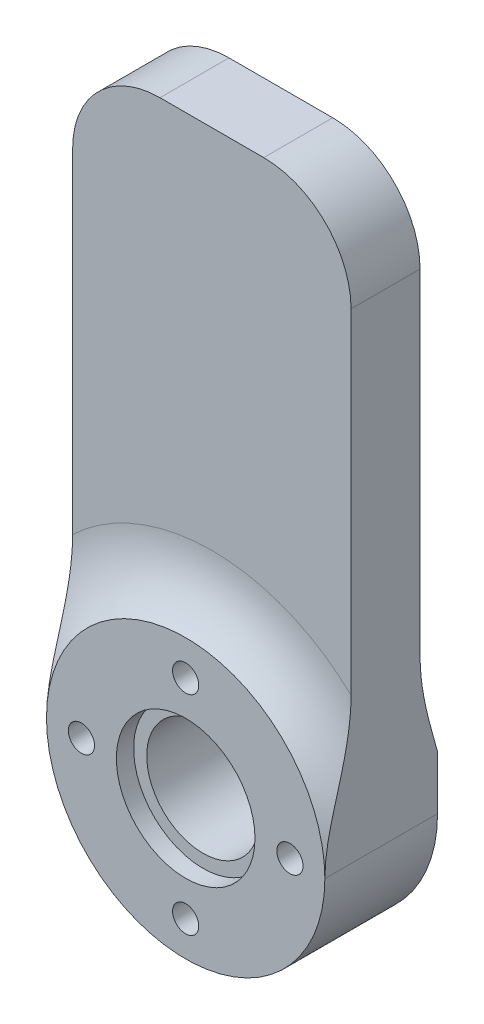
ISO-10303-21;
HEADER;
FILE_DESCRIPTION(('STEP AP214'),'2;1');
FILE_NAME('part.step','',(''),(''),'','','');
FILE_SCHEMA(('AUTOMOTIVE_DESIGN { 1 0 10303 214 1 1 1 1 }'));
ENDSEC;
DATA;
#1=APPLICATION_CONTEXT('core data for automotive mechanical design processes');
#2=APPLICATION_PROTOCOL_DEFINITION('international standard','automotive_design',2000,#1);
#3=PRODUCT_CONTEXT('',#1,'mechanical');
#4=PRODUCT('Part','Part','',(#3));
#5=PRODUCT_RELATED_PRODUCT_CATEGORY('part','',(#4));
#6=PRODUCT_DEFINITION_FORMATION('','',#4);
#7=PRODUCT_DEFINITION_CONTEXT('part definition',#1,'design');
#8=PRODUCT_DEFINITION('design','',#6,#7);
#9=PRODUCT_DEFINITION_SHAPE('','',#8);
#10=(LENGTH_UNIT() NAMED_UNIT(*) SI_UNIT(.MILLI.,.METRE.));
#11=(NAMED_UNIT(*) PLANE_ANGLE_UNIT() SI_UNIT($,.RADIAN.));
#12=(NAMED_UNIT(*) SI_UNIT($,.STERADIAN.) SOLID_ANGLE_UNIT());
#13=UNCERTAINTY_MEASURE_WITH_UNIT(LENGTH_MEASURE(1.E-05),#10,'distance_accuracy_value','');
#14=(GEOMETRIC_REPRESENTATION_CONTEXT(3) GLOBAL_UNCERTAINTY_ASSIGNED_CONTEXT((#13)) GLOBAL_UNIT_ASSIGNED_CONTEXT((#10,
#11,#12)) REPRESENTATION_CONTEXT('',''));
#15=CARTESIAN_POINT('',(0.,0.,0.));
#16=DIRECTION('',(0.,0.,1.));
#17=DIRECTION('',(1.,0.,0.));
#18=AXIS2_PLACEMENT_3D('',#15,#16,#17);
#19=CARTESIAN_POINT('',(15.9375,0.,86.2948591061548));
#20=DIRECTION('',(1.,0.,0.));
#21=DIRECTION('',(0.,0.,-1.));
#22=AXIS2_PLACEMENT_3D('',#19,#20,#21);
#23=PLANE('',#22);
#24=DIRECTION('',(0.,0.,-1.));
#25=VECTOR('',#24,1.);
#26=CARTESIAN_POINT('',(15.9375,0.,86.2948591061548));
#27=LINE('',#26,#25);
#28=CARTESIAN_POINT('',(15.9375,0.,13.9));
#29=VERTEX_POINT('',#28);
#30=CARTESIAN_POINT('',(15.9375,0.,1.));
#31=VERTEX_POINT('',#30);
#32=EDGE_CURVE('E114',#29,#31,#27,.T.);
#33=ORIENTED_EDGE('',*,*,#32,.T.);
#34=DIRECTION('',(0.,1.,0.));
#35=VECTOR('',#34,1.);
#36=CARTESIAN_POINT('',(15.9375,0.,1.));
#37=LINE('',#36,#35);
#38=CARTESIAN_POINT('',(15.9375,6.13888345037508,1.));
#39=VERTEX_POINT('',#38);
#40=EDGE_CURVE('E107',#31,#39,#37,.T.);
#41=ORIENTED_EDGE('',*,*,#40,.T.);
#42=CARTESIAN_POINT('',(15.9375,0.,0.));
#43=CARTESIAN_POINT('',(15.9375,0.179074545514055,-2.48085796920683E-05));
#44=CARTESIAN_POINT('',(15.9375,0.358142913841552,0.00307849751536195));
#45=CARTESIAN_POINT('',(15.9375,0.716044901052748,0.0153581946100619));
#46=CARTESIAN_POINT('',(15.9375,0.894878551618304,0.0245336578060191));
#47=CARTESIAN_POINT('',(15.9375,1.25184642612144,0.0487544690072022));
#48=CARTESIAN_POINT('',(15.9375,1.42998131865605,0.0637900284759467));
#49=CARTESIAN_POINT('',(15.9375,1.78569703822855,0.0993876701854717));
#50=CARTESIAN_POINT('',(15.9375,1.96327784688729,0.119949933818121));
#51=CARTESIAN_POINT('',(15.9375,2.49220382287927,0.188937671858716));
#52=CARTESIAN_POINT('',(15.9375,2.84258108121708,0.244870411283163));
#53=CARTESIAN_POINT('',(15.9375,3.54045283050051,0.372812568066806));
#54=CARTESIAN_POINT('',(15.9375,3.88794599061409,0.444829021114998));
#55=CARTESIAN_POINT('',(15.9375,4.57955409898119,0.600355818186955));
#56=CARTESIAN_POINT('',(15.9375,4.92367453680035,0.68384214845432));
#57=CARTESIAN_POINT('',(15.9375,5.60995725894639,0.858242821962175));
#58=CARTESIAN_POINT('',(15.9375,5.9521197456399,0.949156382151854));
#59=CARTESIAN_POINT('',(15.9375,6.63624834269754,1.13487642843831));
#60=CARTESIAN_POINT('',(15.9375,6.97821204564162,1.22969166832789));
#61=CARTESIAN_POINT('',(15.9375,7.66204673243829,1.41966228277741));
#62=CARTESIAN_POINT('',(15.9375,8.00391771553512,1.51481766002514));
#63=CARTESIAN_POINT('',(15.9375,8.68694383292327,1.70210913663573));
#64=CARTESIAN_POINT('',(15.9375,9.02809590770924,1.79425627482523));
#65=CARTESIAN_POINT('',(15.9375,9.71177398205268,1.97332633226089));
#66=CARTESIAN_POINT('',(15.9375,10.0542999516309,2.06024936484601));
#67=CARTESIAN_POINT('',(15.9375,10.740581582424,2.2263302188011));
#68=CARTESIAN_POINT('',(15.9375,11.0843338334846,2.30550199756693));
#69=CARTESIAN_POINT('',(15.9375,11.7739439857165,2.45404554246196));
#70=CARTESIAN_POINT('',(15.9375,12.1198017352638,2.52341800576494));
#71=CARTESIAN_POINT('',(15.9375,12.8143509160775,2.65039666998206));
#72=CARTESIAN_POINT('',(15.9375,13.1630463839792,2.70798103537374));
#73=CARTESIAN_POINT('',(15.9375,13.8624169692182,2.80920339331623));
#74=CARTESIAN_POINT('',(15.9375,14.2130917375582,2.85284377087802));
#75=CARTESIAN_POINT('',(15.9375,14.9179098150961,2.9244295081681));
#76=CARTESIAN_POINT('',(15.9375,15.2720616845688,2.95229266956463));
#77=CARTESIAN_POINT('',(15.9375,15.9815419137289,2.99008978793062));
#78=CARTESIAN_POINT('',(15.9375,16.336870900139,3.00001178489919));
#79=CARTESIAN_POINT('',(15.9375,16.692304549097,3.));
#80=B_SPLINE_CURVE_WITH_KNOTS('',3,(#42,#43,#44,#45,#46,#47,#48,#49,#50,#51,#52,#53,#54,#55,#56,
#57,#58,#59,#60,#61,#62,#63,#64,#65,#66,#67,#68,#69,#70,#71,#72,#73,#74,#75,#76,#77,#78,#79),
.UNSPECIFIED.,.F.,.F.,(4,2,2,2,2,2,2,2,2,2,2,2,2,2,2,2,2,2,4),(0.,0.537186686060664,
1.0742913108799,1.6105025902815,2.14673147081438,3.21063506389927,4.27500496766301,
5.33717949520935,6.39924218214896,7.46383368326906,8.52843361556566,9.58854475986095,
10.6486328963332,11.7067756397155,12.7648430634147,13.8248529948094,14.884681522551,
15.9499820534179,17.0159924771573),.UNSPECIFIED.);
#81=CARTESIAN_POINT('',(15.9375,16.692304549097,3.));
#82=VERTEX_POINT('',#81);
#83=EDGE_CURVE('E58',#39,#82,#80,.T.);
#84=ORIENTED_EDGE('',*,*,#83,.T.);
#85=DIRECTION('',(0.,-1.,0.));
#86=VECTOR('',#85,1.);
#87=CARTESIAN_POINT('',(15.9375,0.,3.));
#88=LINE('',#87,#86);
#89=CARTESIAN_POINT('',(15.9375,55.,3.));
#90=VERTEX_POINT('',#89);
#91=EDGE_CURVE('E284',#90,#82,#88,.T.);
#92=ORIENTED_EDGE('',*,*,#91,.F.);
#93=DIRECTION('',(0.,0.,-1.));
#94=VECTOR('',#93,1.);
#95=CARTESIAN_POINT('',(15.9375,55.,86.2948591061548));
#96=LINE('',#95,#94);
#97=CARTESIAN_POINT('',(15.9375,55.,10.9));
#98=VERTEX_POINT('',#97);
#99=EDGE_CURVE('E350',#90,#98,#96,.F.);
#100=ORIENTED_EDGE('',*,*,#99,.T.);
#101=DIRECTION('',(0.,1.,0.));
#102=VECTOR('',#101,1.);
#103=CARTESIAN_POINT('',(15.9375,65.,10.9));
#104=LINE('',#103,#102);
#105=CARTESIAN_POINT('',(15.9375,16.692304549097,10.9));
#106=VERTEX_POINT('',#105);
#107=EDGE_CURVE('E271',#106,#98,#104,.T.);
#108=ORIENTED_EDGE('',*,*,#107,.F.);
#109=CARTESIAN_POINT('',(15.9375,16.692304549097,10.9));
#110=CARTESIAN_POINT('',(15.9375,16.4199468231836,10.8999986862448));
#111=CARTESIAN_POINT('',(15.9375,16.1476417148846,10.9058208486351));
#112=CARTESIAN_POINT('',(15.9375,15.60355649983,10.9282703398563));
#113=CARTESIAN_POINT('',(15.9375,15.3317762563185,10.9448943132468));
#114=CARTESIAN_POINT('',(15.9375,14.5188829759938,11.009610594887));
#115=CARTESIAN_POINT('',(15.9375,13.9789254445637,11.0725553157871));
#116=CARTESIAN_POINT('',(15.9375,12.9048083469255,11.2309674408143));
#117=CARTESIAN_POINT('',(15.9375,12.3706415163535,11.3263876120751));
#118=CARTESIAN_POINT('',(15.9375,11.3070688434243,11.5424990033596));
#119=CARTESIAN_POINT('',(15.9375,10.7776675086127,11.6632119655701));
#120=CARTESIAN_POINT('',(15.9375,9.82716550827338,11.8963464774179));
#121=CARTESIAN_POINT('',(15.9375,9.40529591959547,12.0057085555699));
#122=CARTESIAN_POINT('',(15.9375,8.56330820647945,12.2309390175182));
#123=CARTESIAN_POINT('',(15.9375,8.14319011459056,12.3468075216537));
#124=CARTESIAN_POINT('',(15.9375,7.30399581851446,12.5796914824167));
#125=CARTESIAN_POINT('',(15.9375,6.88491901668547,12.6967048388884));
#126=CARTESIAN_POINT('',(15.9375,6.04537696982186,12.9261228631682));
#127=CARTESIAN_POINT('',(15.9375,5.62491143632085,13.0385264986462));
#128=CARTESIAN_POINT('',(15.9375,4.77882361916622,13.2523027075096));
#129=CARTESIAN_POINT('',(15.9375,4.3531859345508,13.3536155559856));
#130=CARTESIAN_POINT('',(15.9375,3.49787068613457,13.5364672854897));
#131=CARTESIAN_POINT('',(15.9375,3.06819668555923,13.6180221653054));
#132=CARTESIAN_POINT('',(15.9375,2.41869474752351,13.7197762516433));
#133=CARTESIAN_POINT('',(15.9375,2.2004883958767,13.7503441974055));
#134=CARTESIAN_POINT('',(15.9375,1.76311234438175,13.8035237512582));
#135=CARTESIAN_POINT('',(15.9375,1.54394271904855,13.8261359641739));
#136=CARTESIAN_POINT('',(15.9375,1.10421192318246,13.8627029983475));
#137=CARTESIAN_POINT('',(15.9375,0.883648550602563,13.8766316510226));
#138=CARTESIAN_POINT('',(15.9375,0.442062469924543,13.8953099631591));
#139=CARTESIAN_POINT('',(15.9375,0.221039633013148,13.9000565552718));
#140=CARTESIAN_POINT('',(15.9375,0.,13.9));
#141=B_SPLINE_CURVE_WITH_KNOTS('',3,(#109,#110,#111,#112,#113,#114,#115,#116,#117,#118,#119,
#120,#121,#122,#123,#124,#125,#126,#127,#128,#129,#130,#131,#132,#133,#134,#135,#136,#137,#138,
#139,#140),.UNSPECIFIED.,.F.,.F.,(4,2,2,2,2,2,2,2,2,2,2,2,2,2,2,4),(0.,0.816925569848742,
1.63359749376208,3.26307569251995,4.89019400603832,6.51871680378922,7.82608365303225,
9.13347469059271,10.4388011591942,11.7444183721199,13.0567524130908,14.3680202280692,
15.0289079681313,15.6897454541294,16.352564918836,17.0156057660451),.UNSPECIFIED.);
#142=EDGE_CURVE('E122',#106,#29,#141,.T.);
#143=ORIENTED_EDGE('',*,*,#142,.T.);
#144=EDGE_LOOP('',(#33,#41,#84,#92,#100,#108,#143));
#145=FACE_BOUND('',#144,.T.);
#146=ADVANCED_FACE('F35',(#145),#23,.T.);
#147=CARTESIAN_POINT('',(-15.9375,0.,86.2948591061548));
#148=DIRECTION('',(-1.,0.,0.));
#149=DIRECTION('',(0.,0.,1.));
#150=AXIS2_PLACEMENT_3D('',#147,#148,#149);
#151=PLANE('',#150);
#152=CARTESIAN_POINT('',(-15.9375,16.692304549097,3.));
#153=CARTESIAN_POINT('',(-15.9375,16.4199468231836,3.00000131375516));
#154=CARTESIAN_POINT('',(-15.9375,16.1476417148846,2.9941791513649));
#155=CARTESIAN_POINT('',(-15.9375,15.60355649983,2.97172966014371));
#156=CARTESIAN_POINT('',(-15.9375,15.3317762563185,2.95510568675318));
#157=CARTESIAN_POINT('',(-15.9375,14.5188829759938,2.89038940511302));
#158=CARTESIAN_POINT('',(-15.9375,13.9789254445637,2.82744468421292));
#159=CARTESIAN_POINT('',(-15.9375,12.9048083469255,2.66903255918569));
#160=CARTESIAN_POINT('',(-15.9375,12.3706415163535,2.57361238792486));
#161=CARTESIAN_POINT('',(-15.9375,11.3070688434243,2.35750099664042));
#162=CARTESIAN_POINT('',(-15.9375,10.7776675086127,2.23678803442993));
#163=CARTESIAN_POINT('',(-15.9375,9.82716550827338,2.00365352258211));
#164=CARTESIAN_POINT('',(-15.9375,9.40529591959547,1.89429144443007));
#165=CARTESIAN_POINT('',(-15.9375,8.56330820647945,1.66906098248185));
#166=CARTESIAN_POINT('',(-15.9375,8.14319011459056,1.55319247834633));
#167=CARTESIAN_POINT('',(-15.9375,7.30399581851445,1.3203085175833));
#168=CARTESIAN_POINT('',(-15.9375,6.88491901668547,1.20329516111158));
#169=CARTESIAN_POINT('',(-15.9375,6.04537696982185,0.973877136831807));
#170=CARTESIAN_POINT('',(-15.9375,5.62491143632085,0.861473501353846));
#171=CARTESIAN_POINT('',(-15.9375,4.77882361916622,0.64769729249036));
#172=CARTESIAN_POINT('',(-15.9375,4.3531859345508,0.546384444014443));
#173=CARTESIAN_POINT('',(-15.9375,3.49787068613457,0.363532714510352));
#174=CARTESIAN_POINT('',(-15.9375,3.06819668555923,0.281977834694555));
#175=CARTESIAN_POINT('',(-15.9375,2.41869474752351,0.180223748356721));
#176=CARTESIAN_POINT('',(-15.9375,2.2004883958767,0.149655802594508));
#177=CARTESIAN_POINT('',(-15.9375,1.76311234438175,0.0964762487417578));
#178=CARTESIAN_POINT('',(-15.9375,1.54394271904855,0.0738640358261242));
#179=CARTESIAN_POINT('',(-15.9375,1.10421192318246,0.0372970016525061));
#180=CARTESIAN_POINT('',(-15.9375,0.883648550602563,0.0233683489773841));
#181=CARTESIAN_POINT('',(-15.9375,0.442062469924542,0.00469003684088393));
#182=CARTESIAN_POINT('',(-15.9375,0.221039633013147,-5.6555271827097E-05));
#183=CARTESIAN_POINT('',(-15.9375,0.,0.));
#184=B_SPLINE_CURVE_WITH_KNOTS('',3,(#152,#153,#154,#155,#156,#157,#158,#159,#160,#161,#162,
#163,#164,#165,#166,#167,#168,#169,#170,#171,#172,#173,#174,#175,#176,#177,#178,#179,#180,#181,
#182,#183),.UNSPECIFIED.,.F.,.F.,(4,2,2,2,2,2,2,2,2,2,2,2,2,2,2,4),(0.,0.816925569848742,
1.63359749376208,3.26307569251996,4.89019400603832,6.51871680378922,7.82608365303225,
9.13347469059271,10.4388011591942,11.7444183721199,13.0567524130908,14.3680202280692,
15.0289079681313,15.6897454541294,16.352564918836,17.0156057660451),.UNSPECIFIED.);
#185=CARTESIAN_POINT('',(-15.9375,16.692304549097,3.));
#186=VERTEX_POINT('',#185);
#187=CARTESIAN_POINT('',(-15.9375,6.13888345037508,0.999999999999996));
#188=VERTEX_POINT('',#187);
#189=EDGE_CURVE('E44',#186,#188,#184,.T.);
#190=ORIENTED_EDGE('',*,*,#189,.T.);
#191=DIRECTION('',(0.,-1.,0.));
#192=VECTOR('',#191,1.);
#193=CARTESIAN_POINT('',(-15.9375,0.,1.));
#194=LINE('',#193,#192);
#195=CARTESIAN_POINT('',(-15.9375,0.,1.));
#196=VERTEX_POINT('',#195);
#197=EDGE_CURVE('E50',#188,#196,#194,.T.);
#198=ORIENTED_EDGE('',*,*,#197,.T.);
#199=DIRECTION('',(0.,0.,-1.));
#200=VECTOR('',#199,1.);
#201=CARTESIAN_POINT('',(-15.9375,0.,86.2948591061548));
#202=LINE('',#201,#200);
#203=CARTESIAN_POINT('',(-15.9375,0.,13.9));
#204=VERTEX_POINT('',#203);
#205=EDGE_CURVE('E286',#204,#196,#202,.T.);
#206=ORIENTED_EDGE('',*,*,#205,.F.);
#207=CARTESIAN_POINT('',(-15.9375,0.,13.9));
#208=CARTESIAN_POINT('',(-15.9375,0.179074545514055,13.9000248085797));
#209=CARTESIAN_POINT('',(-15.9375,0.358142913841553,13.8969215024846));
#210=CARTESIAN_POINT('',(-15.9375,0.716044901052749,13.8846418053899));
#211=CARTESIAN_POINT('',(-15.9375,0.894878551618305,13.875466342194));
#212=CARTESIAN_POINT('',(-15.9375,1.25184642612145,13.8512455309928));
#213=CARTESIAN_POINT('',(-15.9375,1.42998131865606,13.8362099715241));
#214=CARTESIAN_POINT('',(-15.9375,1.78569703822855,13.8006123298145));
#215=CARTESIAN_POINT('',(-15.9375,1.96327784688729,13.7800500661819));
#216=CARTESIAN_POINT('',(-15.9375,2.49220382287927,13.7110623281413));
#217=CARTESIAN_POINT('',(-15.9375,2.84258108121708,13.6551295887168));
#218=CARTESIAN_POINT('',(-15.9375,3.54045283050051,13.5271874319332));
#219=CARTESIAN_POINT('',(-15.9375,3.88794599061409,13.455170978885));
#220=CARTESIAN_POINT('',(-15.9375,4.57955409898119,13.299644181813));
#221=CARTESIAN_POINT('',(-15.9375,4.92367453680035,13.2161578515457));
#222=CARTESIAN_POINT('',(-15.9375,5.60995725894639,13.0417571780378));
#223=CARTESIAN_POINT('',(-15.9375,5.9521197456399,12.9508436178481));
#224=CARTESIAN_POINT('',(-15.9375,6.63624834269754,12.7651235715617));
#225=CARTESIAN_POINT('',(-15.9375,6.97821204564162,12.6703083316721));
#226=CARTESIAN_POINT('',(-15.9375,7.66204673243829,12.4803377172226));
#227=CARTESIAN_POINT('',(-15.9375,8.00391771553512,12.3851823399749));
#228=CARTESIAN_POINT('',(-15.9375,8.68694383292327,12.1978908633643));
#229=CARTESIAN_POINT('',(-15.9375,9.02809590770924,12.1057437251748));
#230=CARTESIAN_POINT('',(-15.9375,9.71177398205268,11.9266736677391));
#231=CARTESIAN_POINT('',(-15.9375,10.0542999516309,11.839750635154));
#232=CARTESIAN_POINT('',(-15.9375,10.740581582424,11.6736697811989));
#233=CARTESIAN_POINT('',(-15.9375,11.0843338334846,11.5944980024331));
#234=CARTESIAN_POINT('',(-15.9375,11.7739439857165,11.445954457538));
#235=CARTESIAN_POINT('',(-15.9375,12.1198017352638,11.3765819942351));
#236=CARTESIAN_POINT('',(-15.9375,12.8143509160775,11.2496033300179));
#237=CARTESIAN_POINT('',(-15.9375,13.1630463839792,11.1920189646263));
#238=CARTESIAN_POINT('',(-15.9375,13.8624169692182,11.0907966066838));
#239=CARTESIAN_POINT('',(-15.9375,14.2130917375582,11.047156229122));
#240=CARTESIAN_POINT('',(-15.9375,14.9179098150961,10.9755704918319));
#241=CARTESIAN_POINT('',(-15.9375,15.2720616845688,10.9477073304354));
#242=CARTESIAN_POINT('',(-15.9375,15.9815419137289,10.9099102120694));
#243=CARTESIAN_POINT('',(-15.9375,16.336870900139,10.8999882151008));
#244=CARTESIAN_POINT('',(-15.9375,16.692304549097,10.9));
#245=B_SPLINE_CURVE_WITH_KNOTS('',3,(#207,#208,#209,#210,#211,#212,#213,#214,#215,#216,#217,
#218,#219,#220,#221,#222,#223,#224,#225,#226,#227,#228,#229,#230,#231,#232,#233,#234,#235,#236,
#237,#238,#239,#240,#241,#242,#243,#244),.UNSPECIFIED.,.F.,.F.,(4,2,2,2,2,2,2,2,2,2,2,2,2,2,2,2,
2,2,4),(0.,0.537186686060664,1.0742913108799,1.6105025902815,2.14673147081438,3.21063506389927,
4.27500496766301,5.33717949520935,6.39924218214896,7.46383368326906,8.52843361556566,
9.58854475986095,10.6486328963332,11.7067756397155,12.7648430634147,13.8248529948094,
14.884681522551,15.9499820534178,17.0159924771573),.UNSPECIFIED.);
#246=CARTESIAN_POINT('',(-15.9375,16.692304549097,10.9));
#247=VERTEX_POINT('',#246);
#248=EDGE_CURVE('E119',#204,#247,#245,.T.);
#249=ORIENTED_EDGE('',*,*,#248,.T.);
#250=DIRECTION('',(0.,-1.,0.));
#251=VECTOR('',#250,1.);
#252=CARTESIAN_POINT('',(-15.9375,0.,10.9));
#253=LINE('',#252,#251);
#254=CARTESIAN_POINT('',(-15.9375,55.,10.9));
#255=VERTEX_POINT('',#254);
#256=EDGE_CURVE('E276',#255,#247,#253,.T.);
#257=ORIENTED_EDGE('',*,*,#256,.F.);
#258=DIRECTION('',(0.,0.,-1.));
#259=VECTOR('',#258,1.);
#260=CARTESIAN_POINT('',(-15.9375,55.,86.2948591061548));
#261=LINE('',#260,#259);
#262=CARTESIAN_POINT('',(-15.9375,55.,3.));
#263=VERTEX_POINT('',#262);
#264=EDGE_CURVE('E324',#255,#263,#261,.T.);
#265=ORIENTED_EDGE('',*,*,#264,.T.);
#266=DIRECTION('',(0.,1.,0.));
#267=VECTOR('',#266,1.);
#268=CARTESIAN_POINT('',(-15.9375,0.,3.));
#269=LINE('',#268,#267);
#270=EDGE_CURVE('E279',#186,#263,#269,.T.);
#271=ORIENTED_EDGE('',*,*,#270,.F.);
#272=EDGE_LOOP('',(#190,#198,#206,#249,#257,#265,#271));
#273=FACE_BOUND('',#272,.T.);
#274=ADVANCED_FACE('F143',(#273),#151,.T.);
#275=CARTESIAN_POINT('',(0.,0.,13.9));
#276=DIRECTION('',(0.,0.,-1.));
#277=DIRECTION('',(-1.,0.,0.));
#278=AXIS2_PLACEMENT_3D('',#275,#276,#277);
#279=CYLINDRICAL_SURFACE('',#278,15.9375);
#280=CARTESIAN_POINT('',(0.,0.,0.999999999999999));
#281=DIRECTION('',(0.,0.,-1.));
#282=DIRECTION('',(-1.,0.,0.));
#283=AXIS2_PLACEMENT_3D('',#280,#281,#282);
#284=CIRCLE('',#283,15.9375);
#285=EDGE_CURVE('E115',#31,#196,#284,.T.);
#286=ORIENTED_EDGE('',*,*,#285,.F.);
#287=ORIENTED_EDGE('',*,*,#32,.F.);
#288=CARTESIAN_POINT('',(0.,0.,13.9));
#289=DIRECTION('',(0.,0.,1.));
#290=DIRECTION('',(1.,0.,0.));
#291=AXIS2_PLACEMENT_3D('',#288,#289,#290);
#292=CIRCLE('',#291,15.9375);
#293=EDGE_CURVE('E310',#204,#29,#292,.T.);
#294=ORIENTED_EDGE('',*,*,#293,.F.);
#295=ORIENTED_EDGE('',*,*,#205,.T.);
#296=EDGE_LOOP('',(#286,#287,#294,#295));
#297=FACE_BOUND('',#296,.T.);
#298=ADVANCED_FACE('F170',(#297),#279,.T.);
#299=CARTESIAN_POINT('',(0.,11.9375,5.5));
#300=DIRECTION('',(0.,0.,-1.));
#301=DIRECTION('',(-1.,0.,0.));
#302=AXIS2_PLACEMENT_3D('',#299,#300,#301);
#303=CYLINDRICAL_SURFACE('',#302,2.75);
#304=CARTESIAN_POINT('',(0.,11.9375,5.5));
#305=DIRECTION('',(0.,0.,-1.));
#306=DIRECTION('',(-1.,0.,0.));
#307=AXIS2_PLACEMENT_3D('',#304,#305,#306);
#308=CIRCLE('',#307,2.75);
#309=CARTESIAN_POINT('',(-2.75,11.9375,5.5));
#310=VERTEX_POINT('',#309);
#311=EDGE_CURVE('E295',#310,#310,#308,.T.);
#312=ORIENTED_EDGE('',*,*,#311,.F.);
#313=EDGE_LOOP('',(#312));
#314=FACE_BOUND('',#313,.T.);
#315=CARTESIAN_POINT('',(0.,11.9375,1.));
#316=DIRECTION('',(0.,0.,-1.));
#317=DIRECTION('',(-1.,0.,0.));
#318=AXIS2_PLACEMENT_3D('',#315,#316,#317);
#319=CIRCLE('',#318,2.75);
#320=CARTESIAN_POINT('',(-2.75,11.9375,1.));
#321=VERTEX_POINT('',#320);
#322=EDGE_CURVE('E255',#321,#321,#319,.F.);
#323=ORIENTED_EDGE('',*,*,#322,.F.);
#324=EDGE_LOOP('',(#323));
#325=FACE_BOUND('',#324,.T.);
#326=ADVANCED_FACE('F173',(#314,#325),#303,.F.);
#327=CARTESIAN_POINT('',(-11.9375000000003,3.37091273150725E-13,5.5));
#328=DIRECTION('',(0.,0.,-1.));
#329=DIRECTION('',(-1.,0.,0.));
#330=AXIS2_PLACEMENT_3D('',#327,#328,#329);
#331=CYLINDRICAL_SURFACE('',#330,2.75);
#332=CARTESIAN_POINT('',(-11.9375000000003,3.37091273150725E-13,5.5));
#333=DIRECTION('',(0.,0.,-1.));
#334=DIRECTION('',(-1.,0.,0.));
#335=AXIS2_PLACEMENT_3D('',#332,#333,#334);
#336=CIRCLE('',#335,2.75);
#337=CARTESIAN_POINT('',(-14.6875000000003,3.37091273150725E-13,5.5));
#338=VERTEX_POINT('',#337);
#339=EDGE_CURVE('E299',#338,#338,#336,.T.);
#340=ORIENTED_EDGE('',*,*,#339,.F.);
#341=EDGE_LOOP('',(#340));
#342=FACE_BOUND('',#341,.T.);
#343=CARTESIAN_POINT('',(-11.9375000000003,3.37091273150725E-13,1.));
#344=DIRECTION('',(0.,0.,-1.));
#345=DIRECTION('',(-1.,0.,0.));
#346=AXIS2_PLACEMENT_3D('',#343,#344,#345);
#347=CIRCLE('',#346,2.75);
#348=CARTESIAN_POINT('',(-14.6875000000003,3.37091273150725E-13,1.));
#349=VERTEX_POINT('',#348);
#350=EDGE_CURVE('E252',#349,#349,#347,.F.);
#351=ORIENTED_EDGE('',*,*,#350,.F.);
#352=EDGE_LOOP('',(#351));
#353=FACE_BOUND('',#352,.T.);
#354=ADVANCED_FACE('F209',(#342,#353),#331,.F.);
#355=CARTESIAN_POINT('',(-6.74182546301449E-13,-11.9375,5.5));
#356=DIRECTION('',(0.,0.,-1.));
#357=DIRECTION('',(-1.,0.,0.));
#358=AXIS2_PLACEMENT_3D('',#355,#356,#357);
#359=CYLINDRICAL_SURFACE('',#358,2.75);
#360=CARTESIAN_POINT('',(-6.74182546301449E-13,-11.9375,5.5));
#361=DIRECTION('',(0.,0.,-1.));
#362=DIRECTION('',(-1.,0.,0.));
#363=AXIS2_PLACEMENT_3D('',#360,#361,#362);
#364=CIRCLE('',#363,2.75);
#365=CARTESIAN_POINT('',(-2.75000000000067,-11.9375,5.5));
#366=VERTEX_POINT('',#365);
#367=EDGE_CURVE('E302',#366,#366,#364,.T.);
#368=ORIENTED_EDGE('',*,*,#367,.F.);
#369=EDGE_LOOP('',(#368));
#370=FACE_BOUND('',#369,.T.);
#371=CARTESIAN_POINT('',(-6.74182546301449E-13,-11.9375,1.));
#372=DIRECTION('',(0.,0.,-1.));
#373=DIRECTION('',(-1.,0.,0.));
#374=AXIS2_PLACEMENT_3D('',#371,#372,#373);
#375=CIRCLE('',#374,2.75);
#376=CARTESIAN_POINT('',(-2.75000000000067,-11.9375,1.));
#377=VERTEX_POINT('',#376);
#378=EDGE_CURVE('E246',#377,#377,#375,.F.);
#379=ORIENTED_EDGE('',*,*,#378,.F.);
#380=EDGE_LOOP('',(#379));
#381=FACE_BOUND('',#380,.T.);
#382=ADVANCED_FACE('F200',(#370,#381),#359,.F.);
#383=CARTESIAN_POINT('',(11.9374999999997,-3.38553195267207E-13,5.5));
#384=DIRECTION('',(0.,0.,-1.));
#385=DIRECTION('',(-1.,0.,0.));
#386=AXIS2_PLACEMENT_3D('',#383,#384,#385);
#387=CYLINDRICAL_SURFACE('',#386,2.75);
#388=CARTESIAN_POINT('',(11.9374999999997,-3.38553195267207E-13,5.5));
#389=DIRECTION('',(0.,0.,-1.));
#390=DIRECTION('',(-1.,0.,0.));
#391=AXIS2_PLACEMENT_3D('',#388,#389,#390);
#392=CIRCLE('',#391,2.75);
#393=CARTESIAN_POINT('',(9.18749999999966,-3.38553195267207E-13,5.5));
#394=VERTEX_POINT('',#393);
#395=EDGE_CURVE('E294',#394,#394,#392,.T.);
#396=ORIENTED_EDGE('',*,*,#395,.F.);
#397=EDGE_LOOP('',(#396));
#398=FACE_BOUND('',#397,.T.);
#399=CARTESIAN_POINT('',(11.9374999999997,-3.38553195267207E-13,1.));
#400=DIRECTION('',(0.,0.,-1.));
#401=DIRECTION('',(-1.,0.,0.));
#402=AXIS2_PLACEMENT_3D('',#399,#400,#401);
#403=CIRCLE('',#402,2.75);
#404=CARTESIAN_POINT('',(9.18749999999966,-3.38553195267207E-13,1.));
#405=VERTEX_POINT('',#404);
#406=EDGE_CURVE('E243',#405,#405,#403,.F.);
#407=ORIENTED_EDGE('',*,*,#406,.F.);
#408=EDGE_LOOP('',(#407));
#409=FACE_BOUND('',#408,.T.);
#410=ADVANCED_FACE('F196',(#398,#409),#387,.F.);
#411=CARTESIAN_POINT('',(0.,0.,2.8578));
#412=DIRECTION('',(0.,0.,-1.));
#413=DIRECTION('',(-1.,0.,0.));
#414=AXIS2_PLACEMENT_3D('',#411,#412,#413);
#415=CYLINDRICAL_SURFACE('',#414,7.9375);
#416=CARTESIAN_POINT('',(0.,0.,2.8578));
#417=DIRECTION('',(0.,0.,-1.));
#418=DIRECTION('',(-1.,0.,0.));
#419=AXIS2_PLACEMENT_3D('',#416,#417,#418);
#420=CIRCLE('',#419,7.9375);
#421=CARTESIAN_POINT('',(-7.9375,0.,2.8578));
#422=VERTEX_POINT('',#421);
#423=EDGE_CURVE('E239',#422,#422,#420,.T.);
#424=ORIENTED_EDGE('',*,*,#423,.F.);
#425=EDGE_LOOP('',(#424));
#426=FACE_BOUND('',#425,.T.);
#427=CARTESIAN_POINT('',(0.,0.,1.));
#428=DIRECTION('',(0.,0.,-1.));
#429=DIRECTION('',(-1.,0.,0.));
#430=AXIS2_PLACEMENT_3D('',#427,#428,#429);
#431=CIRCLE('',#430,7.9375);
#432=CARTESIAN_POINT('',(-7.9375,0.,1.));
#433=VERTEX_POINT('',#432);
#434=EDGE_CURVE('E242',#433,#433,#431,.F.);
#435=ORIENTED_EDGE('',*,*,#434,.F.);
#436=EDGE_LOOP('',(#435));
#437=FACE_BOUND('',#436,.T.);
#438=ADVANCED_FACE('F199',(#426,#437),#415,.F.);
#439=CARTESIAN_POINT('',(0.,0.,-7.));
#440=DIRECTION('',(0.,0.,-1.));
#441=DIRECTION('',(-1.,0.,0.));
#442=AXIS2_PLACEMENT_3D('',#439,#440,#441);
#443=TOROIDAL_SURFACE('',#442,23.0789284285428,10.);
#444=CARTESIAN_POINT('',(0.,0.,1.));
#445=DIRECTION('',(0.,0.,1.));
#446=DIRECTION('',(1.,0.,0.));
#447=AXIS2_PLACEMENT_3D('',#444,#445,#446);
#448=CIRCLE('',#447,17.0789284285428);
#449=EDGE_CURVE('E11',#188,#39,#448,.F.);
#450=ORIENTED_EDGE('',*,*,#449,.F.);
#451=ORIENTED_EDGE('',*,*,#189,.F.);
#452=CARTESIAN_POINT('',(0.,0.,3.));
#453=DIRECTION('',(0.,0.,-1.));
#454=DIRECTION('',(-1.,0.,0.));
#455=AXIS2_PLACEMENT_3D('',#452,#453,#454);
#456=CIRCLE('',#455,23.0789284285428);
#457=EDGE_CURVE('E118',#82,#186,#456,.F.);
#458=ORIENTED_EDGE('',*,*,#457,.F.);
#459=ORIENTED_EDGE('',*,*,#83,.F.);
#460=EDGE_LOOP('',(#450,#451,#458,#459));
#461=FACE_BOUND('',#460,.T.);
#462=ADVANCED_FACE('F37',(#461),#443,.F.);
#463=CARTESIAN_POINT('',(0.,0.,0.));
#464=DIRECTION('',(0.,0.,1.));
#465=DIRECTION('',(1.,0.,0.));
#466=AXIS2_PLACEMENT_3D('',#463,#464,#465);
#467=CYLINDRICAL_SURFACE('',#466,6.4375);
#468=CARTESIAN_POINT('',(0.,0.,2.8578));
#469=DIRECTION('',(0.,0.,-1.));
#470=DIRECTION('',(-1.,0.,0.));
#471=AXIS2_PLACEMENT_3D('',#468,#469,#470);
#472=CIRCLE('',#471,6.4375);
#473=CARTESIAN_POINT('',(-6.4375,0.,2.8578));
#474=VERTEX_POINT('',#473);
#475=EDGE_CURVE('E288',#474,#474,#472,.T.);
#476=ORIENTED_EDGE('',*,*,#475,.T.);
#477=EDGE_LOOP('',(#476));
#478=FACE_BOUND('',#477,.T.);
#479=CARTESIAN_POINT('',(0.,0.,11.9216));
#480=DIRECTION('',(0.,0.,1.));
#481=DIRECTION('',(1.,0.,0.));
#482=AXIS2_PLACEMENT_3D('',#479,#480,#481);
#483=CIRCLE('',#482,6.4375);
#484=CARTESIAN_POINT('',(6.4375,0.,11.9216));
#485=VERTEX_POINT('',#484);
#486=EDGE_CURVE('E262',#485,#485,#483,.F.);
#487=ORIENTED_EDGE('',*,*,#486,.F.);
#488=EDGE_LOOP('',(#487));
#489=FACE_BOUND('',#488,.T.);
#490=ADVANCED_FACE('F227',(#478,#489),#467,.F.);
#491=CARTESIAN_POINT('',(0.,50.,-19.1));
#492=DIRECTION('',(0.,0.,1.));
#493=DIRECTION('',(1.,0.,0.));
#494=AXIS2_PLACEMENT_3D('',#491,#492,#493);
#495=CYLINDRICAL_SURFACE('',#494,3.175);
#496=CARTESIAN_POINT('',(0.,50.,3.));
#497=DIRECTION('',(0.,0.,-1.));
#498=DIRECTION('',(-1.,0.,0.));
#499=AXIS2_PLACEMENT_3D('',#496,#497,#498);
#500=CIRCLE('',#499,3.175);
#501=CARTESIAN_POINT('',(-3.175,50.,3.));
#502=VERTEX_POINT('',#501);
#503=EDGE_CURVE('E268',#502,#502,#500,.T.);
#504=ORIENTED_EDGE('',*,*,#503,.T.);
#505=EDGE_LOOP('',(#504));
#506=FACE_BOUND('',#505,.T.);
#507=CARTESIAN_POINT('',(0.,50.,-7.));
#508=DIRECTION('',(0.,0.,-1.));
#509=DIRECTION('',(-1.,0.,0.));
#510=AXIS2_PLACEMENT_3D('',#507,#508,#509);
#511=CIRCLE('',#510,3.175);
#512=CARTESIAN_POINT('',(-3.175,50.,-7.));
#513=VERTEX_POINT('',#512);
#514=EDGE_CURVE('E265',#513,#513,#511,.T.);
#515=ORIENTED_EDGE('',*,*,#514,.F.);
#516=EDGE_LOOP('',(#515));
#517=FACE_BOUND('',#516,.T.);
#518=ADVANCED_FACE('F229',(#506,#517),#495,.T.);
#519=CARTESIAN_POINT('',(15.9375,65.,86.2948591061548));
#520=DIRECTION('',(0.,1.,0.));
#521=DIRECTION('',(0.,0.,1.));
#522=AXIS2_PLACEMENT_3D('',#519,#520,#521);
#523=PLANE('',#522);
#524=DIRECTION('',(1.,0.,0.));
#525=VECTOR('',#524,1.);
#526=CARTESIAN_POINT('',(0.,65.,3.));
#527=LINE('',#526,#525);
#528=CARTESIAN_POINT('',(-5.9375,65.,3.));
#529=VERTEX_POINT('',#528);
#530=CARTESIAN_POINT('',(5.9375,65.,3.));
#531=VERTEX_POINT('',#530);
#532=EDGE_CURVE('E281',#529,#531,#527,.T.);
#533=ORIENTED_EDGE('',*,*,#532,.F.);
#534=DIRECTION('',(0.,0.,-1.));
#535=VECTOR('',#534,1.);
#536=CARTESIAN_POINT('',(-5.9375,65.,86.2948591061548));
#537=LINE('',#536,#535);
#538=CARTESIAN_POINT('',(-5.9375,65.,10.9));
#539=VERTEX_POINT('',#538);
#540=EDGE_CURVE('E344',#529,#539,#537,.F.);
#541=ORIENTED_EDGE('',*,*,#540,.T.);
#542=DIRECTION('',(-1.,0.,0.));
#543=VECTOR('',#542,1.);
#544=CARTESIAN_POINT('',(-15.9375,65.,10.9));
#545=LINE('',#544,#543);
#546=CARTESIAN_POINT('',(5.9375,65.,10.9));
#547=VERTEX_POINT('',#546);
#548=EDGE_CURVE('E273',#547,#539,#545,.T.);
#549=ORIENTED_EDGE('',*,*,#548,.F.);
#550=DIRECTION('',(0.,0.,-1.));
#551=VECTOR('',#550,1.);
#552=CARTESIAN_POINT('',(5.9375,65.,86.2948591061548));
#553=LINE('',#552,#551);
#554=EDGE_CURVE('E341',#547,#531,#553,.T.);
#555=ORIENTED_EDGE('',*,*,#554,.T.);
#556=EDGE_LOOP('',(#533,#541,#549,#555));
#557=FACE_BOUND('',#556,.T.);
#558=ADVANCED_FACE('F144',(#557),#523,.T.);
#559=CARTESIAN_POINT('',(11.9374999999997,-3.38553195267207E-13,13.9));
#560=DIRECTION('',(0.,0.,-1.));
#561=DIRECTION('',(-1.,0.,0.));
#562=AXIS2_PLACEMENT_3D('',#559,#560,#561);
#563=CYLINDRICAL_SURFACE('',#562,1.50000000000054);
#564=CARTESIAN_POINT('',(11.9374999999997,-3.38553195267207E-13,13.9));
#565=DIRECTION('',(0.,0.,-1.));
#566=DIRECTION('',(-1.,0.,0.));
#567=AXIS2_PLACEMENT_3D('',#564,#565,#566);
#568=CIRCLE('',#567,1.50000000000054);
#569=CARTESIAN_POINT('',(10.4374999999991,-3.38553195267207E-13,13.9));
#570=VERTEX_POINT('',#569);
#571=EDGE_CURVE('E317',#570,#570,#568,.T.);
#572=ORIENTED_EDGE('',*,*,#571,.F.);
#573=EDGE_LOOP('',(#572));
#574=FACE_BOUND('',#573,.T.);
#575=CARTESIAN_POINT('',(11.9374999999997,-3.38553195267207E-13,5.5));
#576=DIRECTION('',(0.,0.,-1.));
#577=DIRECTION('',(-1.,0.,0.));
#578=AXIS2_PLACEMENT_3D('',#575,#576,#577);
#579=CIRCLE('',#578,1.50000000000054);
#580=CARTESIAN_POINT('',(10.4374999999991,-3.38553195267207E-13,5.5));
#581=VERTEX_POINT('',#580);
#582=EDGE_CURVE('E320',#581,#581,#579,.F.);
#583=ORIENTED_EDGE('',*,*,#582,.F.);
#584=EDGE_LOOP('',(#583));
#585=FACE_BOUND('',#584,.T.);
#586=ADVANCED_FACE('F181',(#574,#585),#563,.F.);
#587=CARTESIAN_POINT('',(-6.74182546301449E-13,-11.9375,13.9));
#588=DIRECTION('',(0.,0.,-1.));
#589=DIRECTION('',(-1.,0.,0.));
#590=AXIS2_PLACEMENT_3D('',#587,#588,#589);
#591=CYLINDRICAL_SURFACE('',#590,1.50000000000072);
#592=CARTESIAN_POINT('',(-6.74182546301449E-13,-11.9375,13.9));
#593=DIRECTION('',(0.,0.,-1.));
#594=DIRECTION('',(-1.,0.,0.));
#595=AXIS2_PLACEMENT_3D('',#592,#593,#594);
#596=CIRCLE('',#595,1.50000000000072);
#597=CARTESIAN_POINT('',(-1.5000000000014,-11.9375,13.9));
#598=VERTEX_POINT('',#597);
#599=EDGE_CURVE('E314',#598,#598,#596,.T.);
#600=ORIENTED_EDGE('',*,*,#599,.F.);
#601=EDGE_LOOP('',(#600));
#602=FACE_BOUND('',#601,.T.);
#603=CARTESIAN_POINT('',(-6.74182546301449E-13,-11.9375,5.5));
#604=DIRECTION('',(0.,0.,-1.));
#605=DIRECTION('',(-1.,0.,0.));
#606=AXIS2_PLACEMENT_3D('',#603,#604,#605);
#607=CIRCLE('',#606,1.50000000000072);
#608=CARTESIAN_POINT('',(-1.5000000000014,-11.9375,5.5));
#609=VERTEX_POINT('',#608);
#610=EDGE_CURVE('E330',#609,#609,#607,.F.);
#611=ORIENTED_EDGE('',*,*,#610,.F.);
#612=EDGE_LOOP('',(#611));
#613=FACE_BOUND('',#612,.T.);
#614=ADVANCED_FACE('F184',(#602,#613),#591,.F.);
#615=CARTESIAN_POINT('',(-11.9375000000003,3.37091273150725E-13,13.9));
#616=DIRECTION('',(0.,0.,-1.));
#617=DIRECTION('',(-1.,0.,0.));
#618=AXIS2_PLACEMENT_3D('',#615,#616,#617);
#619=CYLINDRICAL_SURFACE('',#618,1.50000000000026);
#620=CARTESIAN_POINT('',(-11.9375000000003,3.37091273150725E-13,13.9));
#621=DIRECTION('',(0.,0.,-1.));
#622=DIRECTION('',(-1.,0.,0.));
#623=AXIS2_PLACEMENT_3D('',#620,#621,#622);
#624=CIRCLE('',#623,1.50000000000026);
#625=CARTESIAN_POINT('',(-13.4375000000006,3.37091273150725E-13,13.9));
#626=VERTEX_POINT('',#625);
#627=EDGE_CURVE('E311',#626,#626,#624,.T.);
#628=ORIENTED_EDGE('',*,*,#627,.F.);
#629=EDGE_LOOP('',(#628));
#630=FACE_BOUND('',#629,.T.);
#631=CARTESIAN_POINT('',(-11.9375000000003,3.37091273150725E-13,5.5));
#632=DIRECTION('',(0.,0.,-1.));
#633=DIRECTION('',(-1.,0.,0.));
#634=AXIS2_PLACEMENT_3D('',#631,#632,#633);
#635=CIRCLE('',#634,1.50000000000026);
#636=CARTESIAN_POINT('',(-13.4375000000006,3.37091273150725E-13,5.5));
#637=VERTEX_POINT('',#636);
#638=EDGE_CURVE('E327',#637,#637,#635,.F.);
#639=ORIENTED_EDGE('',*,*,#638,.F.);
#640=EDGE_LOOP('',(#639));
#641=FACE_BOUND('',#640,.T.);
#642=ADVANCED_FACE('F188',(#630,#641),#619,.F.);
#643=CARTESIAN_POINT('',(0.,11.9375,13.9));
#644=DIRECTION('',(0.,0.,-1.));
#645=DIRECTION('',(-1.,0.,0.));
#646=AXIS2_PLACEMENT_3D('',#643,#644,#645);
#647=CYLINDRICAL_SURFACE('',#646,1.5);
#648=CARTESIAN_POINT('',(0.,11.9375,13.9));
#649=DIRECTION('',(0.,0.,-1.));
#650=DIRECTION('',(-1.,0.,0.));
#651=AXIS2_PLACEMENT_3D('',#648,#649,#650);
#652=CIRCLE('',#651,1.5);
#653=CARTESIAN_POINT('',(-1.5,11.9375,13.9));
#654=VERTEX_POINT('',#653);
#655=EDGE_CURVE('E307',#654,#654,#652,.T.);
#656=ORIENTED_EDGE('',*,*,#655,.F.);
#657=EDGE_LOOP('',(#656));
#658=FACE_BOUND('',#657,.T.);
#659=CARTESIAN_POINT('',(0.,11.9375,5.5));
#660=DIRECTION('',(0.,0.,-1.));
#661=DIRECTION('',(-1.,0.,0.));
#662=AXIS2_PLACEMENT_3D('',#659,#660,#661);
#663=CIRCLE('',#662,1.5);
#664=CARTESIAN_POINT('',(-1.5,11.9375,5.5));
#665=VERTEX_POINT('',#664);
#666=EDGE_CURVE('E298',#665,#665,#663,.F.);
#667=ORIENTED_EDGE('',*,*,#666,.F.);
#668=EDGE_LOOP('',(#667));
#669=FACE_BOUND('',#668,.T.);
#670=ADVANCED_FACE('F179',(#658,#669),#647,.F.);
#671=CARTESIAN_POINT('',(0.,0.,13.9));
#672=DIRECTION('',(0.,0.,1.));
#673=DIRECTION('',(1.,0.,0.));
#674=AXIS2_PLACEMENT_3D('',#671,#672,#673);
#675=PLANE('',#674);
#676=CARTESIAN_POINT('',(0.,0.,13.9));
#677=DIRECTION('',(0.,0.,1.));
#678=DIRECTION('',(1.,0.,0.));
#679=AXIS2_PLACEMENT_3D('',#676,#677,#678);
#680=CIRCLE('',#679,7.9375);
#681=CARTESIAN_POINT('',(7.9375,0.,13.9));
#682=VERTEX_POINT('',#681);
#683=EDGE_CURVE('E258',#682,#682,#680,.T.);
#684=ORIENTED_EDGE('',*,*,#683,.F.);
#685=EDGE_LOOP('',(#684));
#686=FACE_BOUND('',#685,.T.);
#687=EDGE_CURVE('E321',#29,#204,#292,.T.);
#688=ORIENTED_EDGE('',*,*,#687,.T.);
#689=ORIENTED_EDGE('',*,*,#293,.T.);
#690=EDGE_LOOP('',(#688,#689));
#691=FACE_BOUND('',#690,.T.);
#692=ORIENTED_EDGE('',*,*,#655,.T.);
#693=EDGE_LOOP('',(#692));
#694=FACE_BOUND('',#693,.T.);
#695=ORIENTED_EDGE('',*,*,#627,.T.);
#696=EDGE_LOOP('',(#695));
#697=FACE_BOUND('',#696,.T.);
#698=ORIENTED_EDGE('',*,*,#599,.T.);
#699=EDGE_LOOP('',(#698));
#700=FACE_BOUND('',#699,.T.);
#701=ORIENTED_EDGE('',*,*,#571,.T.);
#702=EDGE_LOOP('',(#701));
#703=FACE_BOUND('',#702,.T.);
#704=ADVANCED_FACE('F175',(#686,#691,#694,#697,#700,#703),#675,.T.);
#705=CARTESIAN_POINT('',(0.,11.9375,5.5));
#706=DIRECTION('',(0.,0.,-1.));
#707=DIRECTION('',(-1.,0.,0.));
#708=AXIS2_PLACEMENT_3D('',#705,#706,#707);
#709=PLANE('',#708);
#710=ORIENTED_EDGE('',*,*,#311,.T.);
#711=EDGE_LOOP('',(#710));
#712=FACE_BOUND('',#711,.T.);
#713=ORIENTED_EDGE('',*,*,#666,.T.);
#714=EDGE_LOOP('',(#713));
#715=FACE_BOUND('',#714,.T.);
#716=ADVANCED_FACE('F178',(#712,#715),#709,.T.);
#717=CARTESIAN_POINT('',(-11.9375000000003,3.37091273150725E-13,5.5));
#718=DIRECTION('',(0.,0.,-1.));
#719=DIRECTION('',(-1.,0.,0.));
#720=AXIS2_PLACEMENT_3D('',#717,#718,#719);
#721=PLANE('',#720);
#722=ORIENTED_EDGE('',*,*,#339,.T.);
#723=EDGE_LOOP('',(#722));
#724=FACE_BOUND('',#723,.T.);
#725=ORIENTED_EDGE('',*,*,#638,.T.);
#726=EDGE_LOOP('',(#725));
#727=FACE_BOUND('',#726,.T.);
#728=ADVANCED_FACE('F213',(#724,#727),#721,.T.);
#729=CARTESIAN_POINT('',(-6.74182546301449E-13,-11.9375,5.5));
#730=DIRECTION('',(0.,0.,-1.));
#731=DIRECTION('',(-1.,0.,0.));
#732=AXIS2_PLACEMENT_3D('',#729,#730,#731);
#733=PLANE('',#732);
#734=ORIENTED_EDGE('',*,*,#367,.T.);
#735=EDGE_LOOP('',(#734));
#736=FACE_BOUND('',#735,.T.);
#737=ORIENTED_EDGE('',*,*,#610,.T.);
#738=EDGE_LOOP('',(#737));
#739=FACE_BOUND('',#738,.T.);
#740=ADVANCED_FACE('F205',(#736,#739),#733,.T.);
#741=CARTESIAN_POINT('',(11.9374999999997,-3.38553195267207E-13,5.5));
#742=DIRECTION('',(0.,0.,-1.));
#743=DIRECTION('',(-1.,0.,0.));
#744=AXIS2_PLACEMENT_3D('',#741,#742,#743);
#745=PLANE('',#744);
#746=ORIENTED_EDGE('',*,*,#395,.T.);
#747=EDGE_LOOP('',(#746));
#748=FACE_BOUND('',#747,.T.);
#749=ORIENTED_EDGE('',*,*,#582,.T.);
#750=EDGE_LOOP('',(#749));
#751=FACE_BOUND('',#750,.T.);
#752=ADVANCED_FACE('F202',(#748,#751),#745,.T.);
#753=CARTESIAN_POINT('',(0.,0.,2.8578));
#754=DIRECTION('',(0.,0.,-1.));
#755=DIRECTION('',(-1.,0.,0.));
#756=AXIS2_PLACEMENT_3D('',#753,#754,#755);
#757=PLANE('',#756);
#758=ORIENTED_EDGE('',*,*,#475,.F.);
#759=EDGE_LOOP('',(#758));
#760=FACE_BOUND('',#759,.T.);
#761=ORIENTED_EDGE('',*,*,#423,.T.);
#762=EDGE_LOOP('',(#761));
#763=FACE_BOUND('',#762,.T.);
#764=ADVANCED_FACE('F145',(#760,#763),#757,.T.);
#765=CARTESIAN_POINT('',(0.,0.,3.));
#766=DIRECTION('',(0.,0.,-1.));
#767=DIRECTION('',(-1.,0.,0.));
#768=AXIS2_PLACEMENT_3D('',#765,#766,#767);
#769=PLANE('',#768);
#770=ORIENTED_EDGE('',*,*,#91,.T.);
#771=ORIENTED_EDGE('',*,*,#457,.T.);
#772=ORIENTED_EDGE('',*,*,#270,.T.);
#773=CARTESIAN_POINT('',(-5.9375,55.,3.));
#774=DIRECTION('',(0.,0.,-1.));
#775=DIRECTION('',(-1.,0.,0.));
#776=AXIS2_PLACEMENT_3D('',#773,#774,#775);
#777=CIRCLE('',#776,10.);
#778=EDGE_CURVE('E339',#263,#529,#777,.T.);
#779=ORIENTED_EDGE('',*,*,#778,.T.);
#780=ORIENTED_EDGE('',*,*,#532,.T.);
#781=CARTESIAN_POINT('',(5.9375,55.,3.));
#782=DIRECTION('',(0.,0.,-1.));
#783=DIRECTION('',(-1.,0.,0.));
#784=AXIS2_PLACEMENT_3D('',#781,#782,#783);
#785=CIRCLE('',#784,10.);
#786=EDGE_CURVE('E337',#531,#90,#785,.T.);
#787=ORIENTED_EDGE('',*,*,#786,.T.);
#788=EDGE_LOOP('',(#770,#771,#772,#779,#780,#787));
#789=FACE_BOUND('',#788,.T.);
#790=ORIENTED_EDGE('',*,*,#503,.F.);
#791=EDGE_LOOP('',(#790));
#792=FACE_BOUND('',#791,.T.);
#793=ADVANCED_FACE('F359',(#789,#792),#769,.T.);
#794=CARTESIAN_POINT('',(0.,0.,10.9));
#795=DIRECTION('',(0.,0.,1.));
#796=DIRECTION('',(1.,0.,0.));
#797=AXIS2_PLACEMENT_3D('',#794,#795,#796);
#798=PLANE('',#797);
#799=ORIENTED_EDGE('',*,*,#256,.T.);
#800=CARTESIAN_POINT('',(0.,0.,10.9));
#801=DIRECTION('',(0.,0.,1.));
#802=DIRECTION('',(1.,0.,0.));
#803=AXIS2_PLACEMENT_3D('',#800,#801,#802);
#804=CIRCLE('',#803,23.0789284285428);
#805=EDGE_CURVE('E352',#247,#106,#804,.F.);
#806=ORIENTED_EDGE('',*,*,#805,.T.);
#807=ORIENTED_EDGE('',*,*,#107,.T.);
#808=CARTESIAN_POINT('',(5.9375,55.,10.9));
#809=DIRECTION('',(0.,0.,1.));
#810=DIRECTION('',(1.,0.,0.));
#811=AXIS2_PLACEMENT_3D('',#808,#809,#810);
#812=CIRCLE('',#811,10.);
#813=EDGE_CURVE('E346',#98,#547,#812,.T.);
#814=ORIENTED_EDGE('',*,*,#813,.T.);
#815=ORIENTED_EDGE('',*,*,#548,.T.);
#816=CARTESIAN_POINT('',(-5.9375,55.,10.9));
#817=DIRECTION('',(0.,0.,1.));
#818=DIRECTION('',(1.,0.,0.));
#819=AXIS2_PLACEMENT_3D('',#816,#817,#818);
#820=CIRCLE('',#819,10.);
#821=EDGE_CURVE('E348',#539,#255,#820,.T.);
#822=ORIENTED_EDGE('',*,*,#821,.T.);
#823=EDGE_LOOP('',(#799,#806,#807,#814,#815,#822));
#824=FACE_BOUND('',#823,.T.);
#825=ADVANCED_FACE('F168',(#824),#798,.T.);
#826=CARTESIAN_POINT('',(-5.9375,55.,86.2948591061548));
#827=DIRECTION('',(0.,0.,-1.));
#828=DIRECTION('',(-1.,0.,0.));
#829=AXIS2_PLACEMENT_3D('',#826,#827,#828);
#830=CYLINDRICAL_SURFACE('',#829,10.);
#831=ORIENTED_EDGE('',*,*,#821,.F.);
#832=ORIENTED_EDGE('',*,*,#540,.F.);
#833=ORIENTED_EDGE('',*,*,#778,.F.);
#834=ORIENTED_EDGE('',*,*,#264,.F.);
#835=EDGE_LOOP('',(#831,#832,#833,#834));
#836=FACE_BOUND('',#835,.T.);
#837=ADVANCED_FACE('F164',(#836),#830,.T.);
#838=CARTESIAN_POINT('',(5.9375,55.,86.2948591061548));
#839=DIRECTION('',(0.,0.,-1.));
#840=DIRECTION('',(-1.,0.,0.));
#841=AXIS2_PLACEMENT_3D('',#838,#839,#840);
#842=CYLINDRICAL_SURFACE('',#841,10.);
#843=ORIENTED_EDGE('',*,*,#813,.F.);
#844=ORIENTED_EDGE('',*,*,#99,.F.);
#845=ORIENTED_EDGE('',*,*,#786,.F.);
#846=ORIENTED_EDGE('',*,*,#554,.F.);
#847=EDGE_LOOP('',(#843,#844,#845,#846));
#848=FACE_BOUND('',#847,.T.);
#849=ADVANCED_FACE('F159',(#848),#842,.T.);
#850=CARTESIAN_POINT('',(0.,0.,20.9));
#851=DIRECTION('',(0.,0.,1.));
#852=DIRECTION('',(1.,0.,0.));
#853=AXIS2_PLACEMENT_3D('',#850,#851,#852);
#854=TOROIDAL_SURFACE('',#853,23.0789284285428,10.);
#855=ORIENTED_EDGE('',*,*,#248,.F.);
#856=ORIENTED_EDGE('',*,*,#687,.F.);
#857=ORIENTED_EDGE('',*,*,#142,.F.);
#858=ORIENTED_EDGE('',*,*,#805,.F.);
#859=EDGE_LOOP('',(#855,#856,#857,#858));
#860=FACE_BOUND('',#859,.T.);
#861=ADVANCED_FACE('F154',(#860),#854,.F.);
#862=CARTESIAN_POINT('',(0.,50.,-7.));
#863=DIRECTION('',(0.,0.,-1.));
#864=DIRECTION('',(-1.,0.,0.));
#865=AXIS2_PLACEMENT_3D('',#862,#863,#864);
#866=PLANE('',#865);
#867=ORIENTED_EDGE('',*,*,#514,.T.);
#868=EDGE_LOOP('',(#867));
#869=FACE_BOUND('',#868,.T.);
#870=ADVANCED_FACE('F158',(#869),#866,.T.);
#871=CARTESIAN_POINT('',(0.,0.,11.9216));
#872=DIRECTION('',(0.,0.,1.));
#873=DIRECTION('',(1.,0.,0.));
#874=AXIS2_PLACEMENT_3D('',#871,#872,#873);
#875=PLANE('',#874);
#876=CARTESIAN_POINT('',(0.,0.,11.9216));
#877=DIRECTION('',(0.,0.,1.));
#878=DIRECTION('',(1.,0.,0.));
#879=AXIS2_PLACEMENT_3D('',#876,#877,#878);
#880=CIRCLE('',#879,7.9375);
#881=CARTESIAN_POINT('',(7.9375,0.,11.9216));
#882=VERTEX_POINT('',#881);
#883=EDGE_CURVE('E259',#882,#882,#880,.T.);
#884=ORIENTED_EDGE('',*,*,#883,.T.);
#885=EDGE_LOOP('',(#884));
#886=FACE_BOUND('',#885,.T.);
#887=ORIENTED_EDGE('',*,*,#486,.T.);
#888=EDGE_LOOP('',(#887));
#889=FACE_BOUND('',#888,.T.);
#890=ADVANCED_FACE('F462',(#886,#889),#875,.T.);
#891=CARTESIAN_POINT('',(0.,0.,11.9216));
#892=DIRECTION('',(0.,0.,1.));
#893=DIRECTION('',(1.,0.,0.));
#894=AXIS2_PLACEMENT_3D('',#891,#892,#893);
#895=CYLINDRICAL_SURFACE('',#894,7.9375);
#896=ORIENTED_EDGE('',*,*,#883,.F.);
#897=EDGE_LOOP('',(#896));
#898=FACE_BOUND('',#897,.T.);
#899=ORIENTED_EDGE('',*,*,#683,.T.);
#900=EDGE_LOOP('',(#899));
#901=FACE_BOUND('',#900,.T.);
#902=ADVANCED_FACE('F458',(#898,#901),#895,.F.);
#903=CARTESIAN_POINT('',(0.,0.,1.));
#904=DIRECTION('',(0.,0.,-1.));
#905=DIRECTION('',(-1.,0.,0.));
#906=AXIS2_PLACEMENT_3D('',#903,#904,#905);
#907=PLANE('',#906);
#908=ORIENTED_EDGE('',*,*,#285,.T.);
#909=ORIENTED_EDGE('',*,*,#197,.F.);
#910=ORIENTED_EDGE('',*,*,#449,.T.);
#911=ORIENTED_EDGE('',*,*,#40,.F.);
#912=EDGE_LOOP('',(#908,#909,#910,#911));
#913=FACE_BOUND('',#912,.T.);
#914=ORIENTED_EDGE('',*,*,#434,.T.);
#915=EDGE_LOOP('',(#914));
#916=FACE_BOUND('',#915,.T.);
#917=ORIENTED_EDGE('',*,*,#406,.T.);
#918=EDGE_LOOP('',(#917));
#919=FACE_BOUND('',#918,.T.);
#920=ORIENTED_EDGE('',*,*,#378,.T.);
#921=EDGE_LOOP('',(#920));
#922=FACE_BOUND('',#921,.T.);
#923=ORIENTED_EDGE('',*,*,#350,.T.);
#924=EDGE_LOOP('',(#923));
#925=FACE_BOUND('',#924,.T.);
#926=ORIENTED_EDGE('',*,*,#322,.T.);
#927=EDGE_LOOP('',(#926));
#928=FACE_BOUND('',#927,.T.);
#929=ADVANCED_FACE('F105',(#913,#916,#919,#922,#925,#928),#907,.T.);
#930=CLOSED_SHELL('',(#146,#274,#298,#326,#354,#382,#410,#438,#462,#490,#518,#558,#586,#614,
#642,#670,#704,#716,#728,#740,#752,#764,#793,#825,#837,#849,#861,#870,#890,#902,#929));
#931=MANIFOLD_SOLID_BREP('B2',#930);
#932=ADVANCED_BREP_SHAPE_REPRESENTATION('',(#18,#931),#14);
#933=SHAPE_DEFINITION_REPRESENTATION(#9,#932);
ENDSEC;
END-ISO-10303-21;
